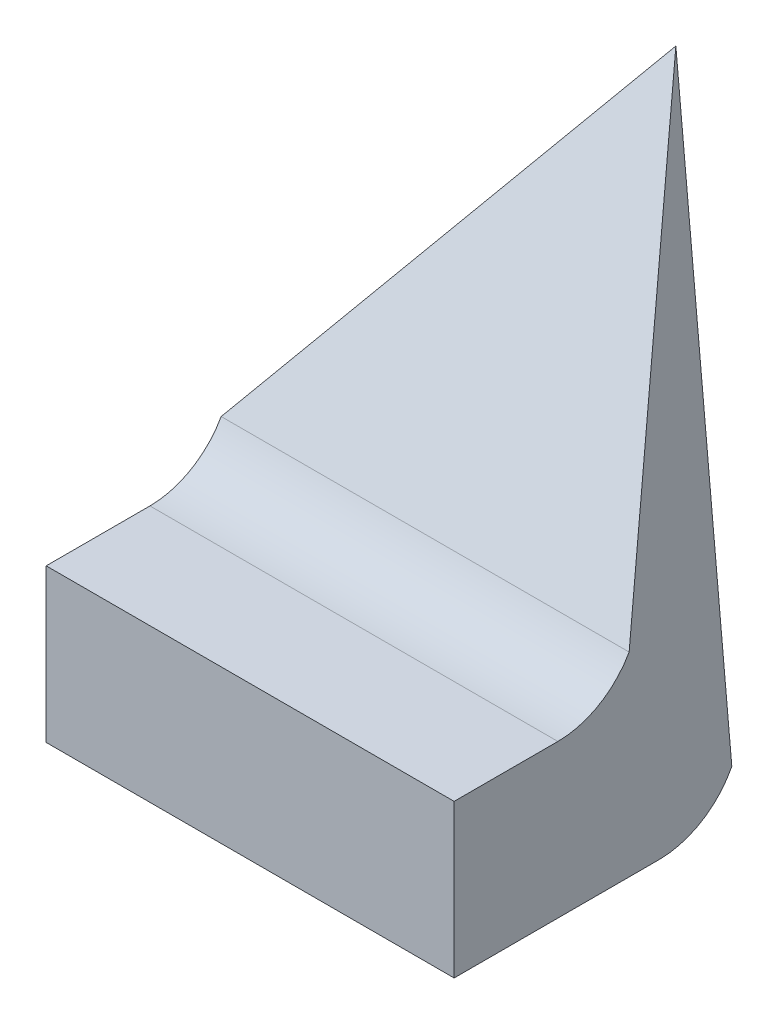
ISO-10303-21;
HEADER;
FILE_DESCRIPTION(('STEP AP214'),'2;1');
FILE_NAME('part.step','',(''),(''),'','','');
FILE_SCHEMA(('AUTOMOTIVE_DESIGN { 1 0 10303 214 1 1 1 1 }'));
ENDSEC;
DATA;
#1=APPLICATION_CONTEXT('core data for automotive mechanical design processes');
#2=APPLICATION_PROTOCOL_DEFINITION('international standard','automotive_design',2000,#1);
#3=PRODUCT_CONTEXT('',#1,'mechanical');
#4=PRODUCT('Part','Part','',(#3));
#5=PRODUCT_RELATED_PRODUCT_CATEGORY('part','',(#4));
#6=PRODUCT_DEFINITION_FORMATION('','',#4);
#7=PRODUCT_DEFINITION_CONTEXT('part definition',#1,'design');
#8=PRODUCT_DEFINITION('design','',#6,#7);
#9=PRODUCT_DEFINITION_SHAPE('','',#8);
#10=(LENGTH_UNIT() NAMED_UNIT(*) SI_UNIT(.MILLI.,.METRE.));
#11=(NAMED_UNIT(*) PLANE_ANGLE_UNIT() SI_UNIT($,.RADIAN.));
#12=(NAMED_UNIT(*) SI_UNIT($,.STERADIAN.) SOLID_ANGLE_UNIT());
#13=UNCERTAINTY_MEASURE_WITH_UNIT(LENGTH_MEASURE(1.E-05),#10,'distance_accuracy_value','');
#14=(GEOMETRIC_REPRESENTATION_CONTEXT(3) GLOBAL_UNCERTAINTY_ASSIGNED_CONTEXT((#13)) GLOBAL_UNIT_ASSIGNED_CONTEXT((#10,
#11,#12)) REPRESENTATION_CONTEXT('',''));
#15=CARTESIAN_POINT('',(0.,0.,0.));
#16=DIRECTION('',(0.,0.,1.));
#17=DIRECTION('',(1.,0.,0.));
#18=AXIS2_PLACEMENT_3D('',#15,#16,#17);
#19=CARTESIAN_POINT('',(-72.48907229268,21.89380350451,24.069563060296));
#20=DIRECTION('',(0.,0.455111059789055,0.890434682196108));
#21=DIRECTION('',(0.,-0.890434682196108,0.455111059789055));
#22=AXIS2_PLACEMENT_3D('',#19,#20,#21);
#23=PLANE('',#22);
#24=DIRECTION('',(1.,0.,0.));
#25=VECTOR('',#24,1.);
#26=CARTESIAN_POINT('',(-72.48907229268,21.8938035045101,24.0695630602962));
#27=LINE('',#26,#25);
#28=CARTESIAN_POINT('',(-72.48907229268,21.8938035045099,24.0695630602962));
#29=VERTEX_POINT('',#28);
#30=CARTESIAN_POINT('',(-72.08907229268,21.8938035045099,24.0695630602962));
#31=VERTEX_POINT('',#30);
#32=EDGE_CURVE('E83',#29,#31,#27,.T.);
#33=ORIENTED_EDGE('',*,*,#32,.F.);
#34=DIRECTION('',(0.,-0.890434682195813,0.455111059789631));
#35=VECTOR('',#34,1.);
#36=CARTESIAN_POINT('',(-72.48907229268,22.256621274076,23.884122866962));
#37=LINE('',#36,#35);
#38=CARTESIAN_POINT('',(-72.28907229268,22.3329201022555,23.9244295892155));
#39=VERTEX_POINT('',#38);
#40=EDGE_CURVE('E47',#39,#29,#37,.T.);
#41=ORIENTED_EDGE('',*,*,#40,.F.);
#42=DIRECTION('',(0.,-0.890434682195813,0.455111059789631));
#43=VECTOR('',#42,1.);
#44=CARTESIAN_POINT('',(-72.08907229268,22.256621274076,23.884122866962));
#45=LINE('',#44,#43);
#46=EDGE_CURVE('E97',#39,#31,#45,.T.);
#47=ORIENTED_EDGE('',*,*,#46,.T.);
#48=EDGE_LOOP('',(#33,#41,#47));
#49=FACE_BOUND('',#48,.T.);
#50=ADVANCED_FACE('F17',(#49),#23,.F.);
#51=CARTESIAN_POINT('',(-72.48907229268,21.930212389293,24.140797834872));
#52=DIRECTION('',(1.,0.,0.));
#53=DIRECTION('',(0.,0.,-1.));
#54=AXIS2_PLACEMENT_3D('',#51,#52,#53);
#55=CYLINDRICAL_SURFACE('',#54,0.08);
#56=CARTESIAN_POINT('',(-72.48907229268,21.930212389293,24.140797834872));
#57=DIRECTION('',(1.,0.,0.));
#58=DIRECTION('',(0.,0.,-1.));
#59=AXIS2_PLACEMENT_3D('',#56,#57,#58);
#60=CIRCLE('',#59,0.08);
#61=CARTESIAN_POINT('',(-72.48907229268,21.850212389293,24.140797834872));
#62=VERTEX_POINT('',#61);
#63=EDGE_CURVE('E20',#29,#62,#60,.F.);
#64=ORIENTED_EDGE('',*,*,#63,.F.);
#65=ORIENTED_EDGE('',*,*,#32,.T.);
#66=CARTESIAN_POINT('',(-72.08907229268,21.930212389293,24.140797834872));
#67=DIRECTION('',(1.,0.,0.));
#68=DIRECTION('',(0.,0.,-1.));
#69=AXIS2_PLACEMENT_3D('',#66,#67,#68);
#70=CIRCLE('',#69,0.08);
#71=CARTESIAN_POINT('',(-72.08907229268,21.850212389293,24.140797834872));
#72=VERTEX_POINT('',#71);
#73=EDGE_CURVE('E90',#31,#72,#70,.F.);
#74=ORIENTED_EDGE('',*,*,#73,.T.);
#75=DIRECTION('',(1.,0.,0.));
#76=VECTOR('',#75,1.);
#77=CARTESIAN_POINT('',(-72.48907229268,21.850212389293,24.140797834872));
#78=LINE('',#77,#76);
#79=EDGE_CURVE('E76',#72,#62,#78,.F.);
#80=ORIENTED_EDGE('',*,*,#79,.T.);
#81=EDGE_LOOP('',(#64,#65,#74,#80));
#82=FACE_BOUND('',#81,.T.);
#83=ADVANCED_FACE('F96',(#82),#55,.T.);
#84=CARTESIAN_POINT('',(-72.48907229268,21.850212389293,24.341842963629));
#85=DIRECTION('',(0.,1.,0.));
#86=DIRECTION('',(0.,0.,1.));
#87=AXIS2_PLACEMENT_3D('',#84,#85,#86);
#88=PLANE('',#87);
#89=DIRECTION('',(-1.,0.,0.));
#90=VECTOR('',#89,1.);
#91=CARTESIAN_POINT('',(-72.48907229268,21.850212389293,24.341842963629));
#92=LINE('',#91,#90);
#93=CARTESIAN_POINT('',(-72.08907229268,21.850212389293,24.341842963629));
#94=VERTEX_POINT('',#93);
#95=CARTESIAN_POINT('',(-72.48907229268,21.850212389293,24.341842963629));
#96=VERTEX_POINT('',#95);
#97=EDGE_CURVE('E82',#94,#96,#92,.T.);
#98=ORIENTED_EDGE('',*,*,#97,.T.);
#99=DIRECTION('',(0.,0.,1.));
#100=VECTOR('',#99,1.);
#101=CARTESIAN_POINT('',(-72.48907229268,21.850212389293,23.894890125116));
#102=LINE('',#101,#100);
#103=EDGE_CURVE('E57',#62,#96,#102,.T.);
#104=ORIENTED_EDGE('',*,*,#103,.F.);
#105=ORIENTED_EDGE('',*,*,#79,.F.);
#106=DIRECTION('',(0.,0.,1.));
#107=VECTOR('',#106,1.);
#108=CARTESIAN_POINT('',(-72.08907229268,21.850212389293,23.894890125116));
#109=LINE('',#108,#107);
#110=EDGE_CURVE('E79',#72,#94,#109,.T.);
#111=ORIENTED_EDGE('',*,*,#110,.T.);
#112=EDGE_LOOP('',(#98,#104,#105,#111));
#113=FACE_BOUND('',#112,.T.);
#114=ADVANCED_FACE('F78',(#113),#88,.F.);
#115=CARTESIAN_POINT('',(-72.48907229268,22.000212389293,24.341842963629));
#116=DIRECTION('',(0.,0.,-1.));
#117=DIRECTION('',(-1.,0.,0.));
#118=AXIS2_PLACEMENT_3D('',#115,#116,#117);
#119=PLANE('',#118);
#120=DIRECTION('',(1.,0.,0.));
#121=VECTOR('',#120,1.);
#122=CARTESIAN_POINT('',(-72.48907229268,22.000212389293,24.341842963629));
#123=LINE('',#122,#121);
#124=CARTESIAN_POINT('',(-72.08907229268,22.000212389293,24.341842963629));
#125=VERTEX_POINT('',#124);
#126=CARTESIAN_POINT('',(-72.48907229268,22.000212389293,24.341842963629));
#127=VERTEX_POINT('',#126);
#128=EDGE_CURVE('E123',#125,#127,#123,.F.);
#129=ORIENTED_EDGE('',*,*,#128,.T.);
#130=DIRECTION('',(0.,1.,0.));
#131=VECTOR('',#130,1.);
#132=CARTESIAN_POINT('',(-72.48907229268,22.370212389293,24.341842963629));
#133=LINE('',#132,#131);
#134=EDGE_CURVE('E104',#96,#127,#133,.T.);
#135=ORIENTED_EDGE('',*,*,#134,.F.);
#136=ORIENTED_EDGE('',*,*,#97,.F.);
#137=DIRECTION('',(0.,1.,0.));
#138=VECTOR('',#137,1.);
#139=CARTESIAN_POINT('',(-72.08907229268,22.370212389293,24.341842963629));
#140=LINE('',#139,#138);
#141=EDGE_CURVE('E94',#94,#125,#140,.T.);
#142=ORIENTED_EDGE('',*,*,#141,.T.);
#143=EDGE_LOOP('',(#129,#135,#136,#142));
#144=FACE_BOUND('',#143,.T.);
#145=ADVANCED_FACE('F138',(#144),#119,.F.);
#146=CARTESIAN_POINT('',(-72.48907229268,22.000212389293,24.240104347825));
#147=DIRECTION('',(0.,-1.,0.));
#148=DIRECTION('',(0.,0.,-1.));
#149=AXIS2_PLACEMENT_3D('',#146,#147,#148);
#150=PLANE('',#149);
#151=DIRECTION('',(1.,0.,0.));
#152=VECTOR('',#151,1.);
#153=CARTESIAN_POINT('',(-72.48907229268,22.000212389293,24.240104347825));
#154=LINE('',#153,#152);
#155=CARTESIAN_POINT('',(-72.08907229268,22.000212389293,24.240104347825));
#156=VERTEX_POINT('',#155);
#157=CARTESIAN_POINT('',(-72.48907229268,22.000212389293,24.240104347825));
#158=VERTEX_POINT('',#157);
#159=EDGE_CURVE('E119',#156,#158,#154,.F.);
#160=ORIENTED_EDGE('',*,*,#159,.T.);
#161=DIRECTION('',(0.,0.,1.));
#162=VECTOR('',#161,1.);
#163=CARTESIAN_POINT('',(-72.48907229268,22.000212389293,23.894890125116));
#164=LINE('',#163,#162);
#165=EDGE_CURVE('E103',#127,#158,#164,.F.);
#166=ORIENTED_EDGE('',*,*,#165,.F.);
#167=ORIENTED_EDGE('',*,*,#128,.F.);
#168=DIRECTION('',(0.,0.,1.));
#169=VECTOR('',#168,1.);
#170=CARTESIAN_POINT('',(-72.08907229268,22.000212389293,23.894890125116));
#171=LINE('',#170,#169);
#172=EDGE_CURVE('E129',#125,#156,#171,.F.);
#173=ORIENTED_EDGE('',*,*,#172,.T.);
#174=EDGE_LOOP('',(#160,#166,#167,#173));
#175=FACE_BOUND('',#174,.T.);
#176=ADVANCED_FACE('F151',(#175),#150,.F.);
#177=CARTESIAN_POINT('',(-72.48907229268,22.080212389293,24.240104347825));
#178=DIRECTION('',(1.,0.,0.));
#179=DIRECTION('',(0.,0.,-1.));
#180=AXIS2_PLACEMENT_3D('',#177,#178,#179);
#181=CYLINDRICAL_SURFACE('',#180,0.08);
#182=CARTESIAN_POINT('',(-72.48907229268,22.080212389293,24.240104347825));
#183=DIRECTION('',(1.,0.,0.));
#184=DIRECTION('',(0.,0.,-1.));
#185=AXIS2_PLACEMENT_3D('',#182,#183,#184);
#186=CIRCLE('',#185,0.08);
#187=CARTESIAN_POINT('',(-72.48907229268,22.0412058481507,24.1702581614708));
#188=VERTEX_POINT('',#187);
#189=EDGE_CURVE('E35',#158,#188,#186,.T.);
#190=ORIENTED_EDGE('',*,*,#189,.F.);
#191=ORIENTED_EDGE('',*,*,#159,.F.);
#192=CARTESIAN_POINT('',(-72.08907229268,22.080212389293,24.240104347825));
#193=DIRECTION('',(1.,0.,0.));
#194=DIRECTION('',(0.,0.,-1.));
#195=AXIS2_PLACEMENT_3D('',#192,#193,#194);
#196=CIRCLE('',#195,0.08);
#197=CARTESIAN_POINT('',(-72.08907229268,22.0412058481507,24.1702581614708));
#198=VERTEX_POINT('',#197);
#199=EDGE_CURVE('E101',#156,#198,#196,.T.);
#200=ORIENTED_EDGE('',*,*,#199,.T.);
#201=DIRECTION('',(1.,0.,0.));
#202=VECTOR('',#201,1.);
#203=CARTESIAN_POINT('',(-72.48907229268,22.0412058481508,24.1702581614707));
#204=LINE('',#203,#202);
#205=EDGE_CURVE('E161',#198,#188,#204,.F.);
#206=ORIENTED_EDGE('',*,*,#205,.T.);
#207=EDGE_LOOP('',(#190,#191,#200,#206));
#208=FACE_BOUND('',#207,.T.);
#209=ADVANCED_FACE('F142',(#208),#181,.F.);
#210=CARTESIAN_POINT('',(-72.48907229268,22.370212389293,23.894890125116));
#211=DIRECTION('',(-1.,0.,0.));
#212=DIRECTION('',(0.,0.,1.));
#213=AXIS2_PLACEMENT_3D('',#210,#211,#212);
#214=PLANE('',#213);
#215=DIRECTION('',(0.,0.873077329419039,-0.487581764276022));
#216=VECTOR('',#215,1.);
#217=CARTESIAN_POINT('',(-72.48907229268,22.409218930435,23.964736311469));
#218=LINE('',#217,#216);
#219=EDGE_CURVE('E26',#188,#39,#218,.T.);
#220=ORIENTED_EDGE('',*,*,#219,.T.);
#221=ORIENTED_EDGE('',*,*,#40,.T.);
#222=ORIENTED_EDGE('',*,*,#63,.T.);
#223=ORIENTED_EDGE('',*,*,#103,.T.);
#224=ORIENTED_EDGE('',*,*,#134,.T.);
#225=ORIENTED_EDGE('',*,*,#165,.T.);
#226=ORIENTED_EDGE('',*,*,#189,.T.);
#227=EDGE_LOOP('',(#220,#221,#222,#223,#224,#225,#226));
#228=FACE_BOUND('',#227,.T.);
#229=ADVANCED_FACE('F140',(#228),#214,.T.);
#230=CARTESIAN_POINT('',(-72.08907229268,22.370212389293,23.894890125116));
#231=DIRECTION('',(-1.,0.,0.));
#232=DIRECTION('',(0.,0.,1.));
#233=AXIS2_PLACEMENT_3D('',#230,#231,#232);
#234=PLANE('',#233);
#235=DIRECTION('',(0.,0.873077329419039,-0.487581764276022));
#236=VECTOR('',#235,1.);
#237=CARTESIAN_POINT('',(-72.08907229268,22.409218930435,23.964736311469));
#238=LINE('',#237,#236);
#239=EDGE_CURVE('E11',#39,#198,#238,.F.);
#240=ORIENTED_EDGE('',*,*,#239,.T.);
#241=ORIENTED_EDGE('',*,*,#199,.F.);
#242=ORIENTED_EDGE('',*,*,#172,.F.);
#243=ORIENTED_EDGE('',*,*,#141,.F.);
#244=ORIENTED_EDGE('',*,*,#110,.F.);
#245=ORIENTED_EDGE('',*,*,#73,.F.);
#246=ORIENTED_EDGE('',*,*,#46,.F.);
#247=EDGE_LOOP('',(#240,#241,#242,#243,#244,#245,#246));
#248=FACE_BOUND('',#247,.T.);
#249=ADVANCED_FACE('F88',(#248),#234,.F.);
#250=CARTESIAN_POINT('',(-72.48907229268,22.409218930435,23.964736311469));
#251=DIRECTION('',(0.,-0.487581764276022,-0.873077329419039));
#252=DIRECTION('',(0.,0.873077329419039,-0.487581764276022));
#253=AXIS2_PLACEMENT_3D('',#250,#251,#252);
#254=PLANE('',#253);
#255=ORIENTED_EDGE('',*,*,#219,.F.);
#256=ORIENTED_EDGE('',*,*,#205,.F.);
#257=ORIENTED_EDGE('',*,*,#239,.F.);
#258=EDGE_LOOP('',(#255,#256,#257));
#259=FACE_BOUND('',#258,.T.);
#260=ADVANCED_FACE('F149',(#259),#254,.F.);
#261=CLOSED_SHELL('',(#50,#83,#114,#145,#176,#209,#229,#249,#260));
#262=MANIFOLD_SOLID_BREP('B1',#261);
#263=ADVANCED_BREP_SHAPE_REPRESENTATION('',(#18,#262),#14);
#264=SHAPE_DEFINITION_REPRESENTATION(#9,#263);
ENDSEC;
END-ISO-10303-21;
